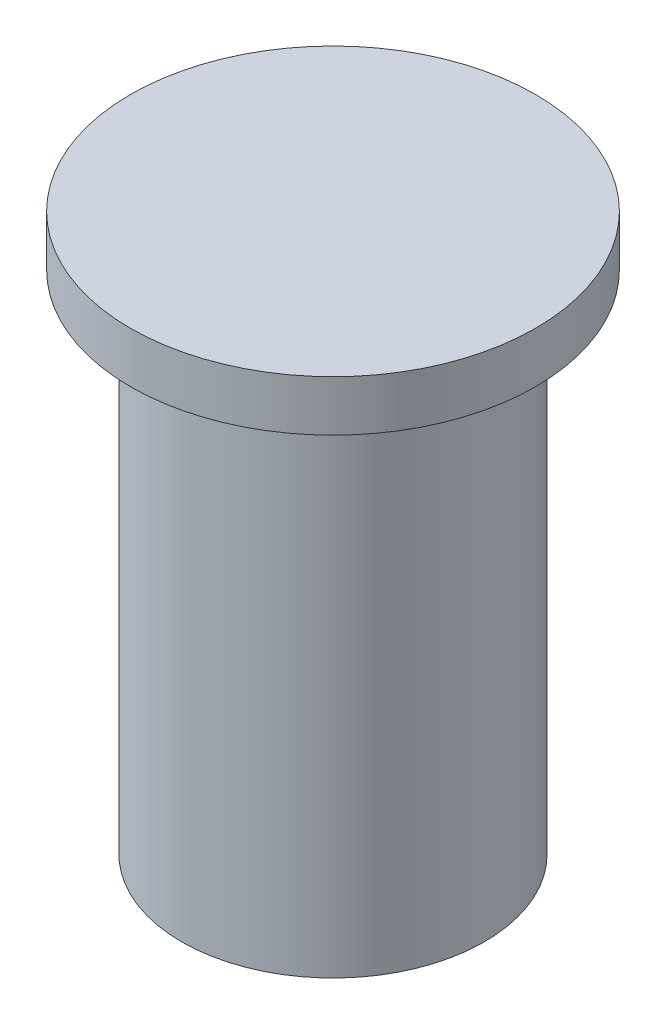
ISO-10303-21;
HEADER;
FILE_DESCRIPTION(('STEP AP214'),'2;1');
FILE_NAME('part.step','',(''),(''),'','','');
FILE_SCHEMA(('AUTOMOTIVE_DESIGN { 1 0 10303 214 1 1 1 1 }'));
ENDSEC;
DATA;
#1=APPLICATION_CONTEXT('core data for automotive mechanical design processes');
#2=APPLICATION_PROTOCOL_DEFINITION('international standard','automotive_design',2000,#1);
#3=PRODUCT_CONTEXT('',#1,'mechanical');
#4=PRODUCT('Part','Part','',(#3));
#5=PRODUCT_RELATED_PRODUCT_CATEGORY('part','',(#4));
#6=PRODUCT_DEFINITION_FORMATION('','',#4);
#7=PRODUCT_DEFINITION_CONTEXT('part definition',#1,'design');
#8=PRODUCT_DEFINITION('design','',#6,#7);
#9=PRODUCT_DEFINITION_SHAPE('','',#8);
#10=(LENGTH_UNIT() NAMED_UNIT(*) SI_UNIT(.MILLI.,.METRE.));
#11=(NAMED_UNIT(*) PLANE_ANGLE_UNIT() SI_UNIT($,.RADIAN.));
#12=(NAMED_UNIT(*) SI_UNIT($,.STERADIAN.) SOLID_ANGLE_UNIT());
#13=UNCERTAINTY_MEASURE_WITH_UNIT(LENGTH_MEASURE(1.E-05),#10,'distance_accuracy_value','');
#14=(GEOMETRIC_REPRESENTATION_CONTEXT(3) GLOBAL_UNCERTAINTY_ASSIGNED_CONTEXT((#13)) GLOBAL_UNIT_ASSIGNED_CONTEXT((#10,
#11,#12)) REPRESENTATION_CONTEXT('',''));
#15=CARTESIAN_POINT('',(0.,0.,0.));
#16=DIRECTION('',(0.,0.,1.));
#17=DIRECTION('',(1.,0.,0.));
#18=AXIS2_PLACEMENT_3D('',#15,#16,#17);
#19=CARTESIAN_POINT('',(0.,150.,0.));
#20=DIRECTION('',(0.,-1.,0.));
#21=DIRECTION('',(0.,0.,-1.));
#22=AXIS2_PLACEMENT_3D('',#19,#20,#21);
#23=CYLINDRICAL_SURFACE('',#22,44.85);
#24=CARTESIAN_POINT('',(0.,150.,0.));
#25=DIRECTION('',(0.,1.,0.));
#26=DIRECTION('',(0.,0.,1.));
#27=AXIS2_PLACEMENT_3D('',#24,#25,#26);
#28=CIRCLE('',#27,44.85);
#29=CARTESIAN_POINT('',(0.,150.,44.85));
#30=VERTEX_POINT('',#29);
#31=EDGE_CURVE('E10',#30,#30,#28,.T.);
#32=ORIENTED_EDGE('',*,*,#31,.F.);
#33=EDGE_LOOP('',(#32));
#34=FACE_BOUND('',#33,.T.);
#35=CARTESIAN_POINT('',(0.,0.,0.));
#36=DIRECTION('',(0.,1.,0.));
#37=DIRECTION('',(0.,0.,1.));
#38=AXIS2_PLACEMENT_3D('',#35,#36,#37);
#39=CIRCLE('',#38,44.85);
#40=CARTESIAN_POINT('',(0.,0.,44.85));
#41=VERTEX_POINT('',#40);
#42=EDGE_CURVE('E34',#41,#41,#39,.T.);
#43=ORIENTED_EDGE('',*,*,#42,.T.);
#44=EDGE_LOOP('',(#43));
#45=FACE_BOUND('',#44,.T.);
#46=ADVANCED_FACE('F31',(#34,#45),#23,.T.);
#47=CARTESIAN_POINT('',(0.,0.,0.));
#48=DIRECTION('',(0.,1.,0.));
#49=DIRECTION('',(0.,0.,1.));
#50=AXIS2_PLACEMENT_3D('',#47,#48,#49);
#51=PLANE('',#50);
#52=ORIENTED_EDGE('',*,*,#42,.F.);
#53=EDGE_LOOP('',(#52));
#54=FACE_BOUND('',#53,.T.);
#55=ADVANCED_FACE('F54',(#54),#51,.F.);
#56=CARTESIAN_POINT('',(0.,165.,0.));
#57=DIRECTION('',(0.,-1.,0.));
#58=DIRECTION('',(0.,0.,-1.));
#59=AXIS2_PLACEMENT_3D('',#56,#57,#58);
#60=CYLINDRICAL_SURFACE('',#59,60.);
#61=CARTESIAN_POINT('',(0.,165.,0.));
#62=DIRECTION('',(0.,1.,0.));
#63=DIRECTION('',(0.,0.,1.));
#64=AXIS2_PLACEMENT_3D('',#61,#62,#63);
#65=CIRCLE('',#64,60.);
#66=CARTESIAN_POINT('',(0.,165.,60.));
#67=VERTEX_POINT('',#66);
#68=EDGE_CURVE('E41',#67,#67,#65,.T.);
#69=ORIENTED_EDGE('',*,*,#68,.F.);
#70=EDGE_LOOP('',(#69));
#71=FACE_BOUND('',#70,.T.);
#72=CARTESIAN_POINT('',(0.,150.,0.));
#73=DIRECTION('',(0.,1.,0.));
#74=DIRECTION('',(0.,0.,1.));
#75=AXIS2_PLACEMENT_3D('',#72,#73,#74);
#76=CIRCLE('',#75,60.);
#77=CARTESIAN_POINT('',(0.,150.,60.));
#78=VERTEX_POINT('',#77);
#79=EDGE_CURVE('E43',#78,#78,#76,.T.);
#80=ORIENTED_EDGE('',*,*,#79,.T.);
#81=EDGE_LOOP('',(#80));
#82=FACE_BOUND('',#81,.T.);
#83=ADVANCED_FACE('F51',(#71,#82),#60,.T.);
#84=CARTESIAN_POINT('',(0.,165.,0.));
#85=DIRECTION('',(0.,1.,0.));
#86=DIRECTION('',(0.,0.,1.));
#87=AXIS2_PLACEMENT_3D('',#84,#85,#86);
#88=PLANE('',#87);
#89=ORIENTED_EDGE('',*,*,#68,.T.);
#90=EDGE_LOOP('',(#89));
#91=FACE_BOUND('',#90,.T.);
#92=ADVANCED_FACE('F49',(#91),#88,.T.);
#93=CARTESIAN_POINT('',(0.,150.,0.));
#94=DIRECTION('',(0.,1.,0.));
#95=DIRECTION('',(0.,0.,1.));
#96=AXIS2_PLACEMENT_3D('',#93,#94,#95);
#97=PLANE('',#96);
#98=ORIENTED_EDGE('',*,*,#31,.T.);
#99=EDGE_LOOP('',(#98));
#100=FACE_BOUND('',#99,.T.);
#101=ORIENTED_EDGE('',*,*,#79,.F.);
#102=EDGE_LOOP('',(#101));
#103=FACE_BOUND('',#102,.T.);
#104=ADVANCED_FACE('F58',(#100,#103),#97,.F.);
#105=CLOSED_SHELL('',(#46,#55,#83,#92,#104));
#106=MANIFOLD_SOLID_BREP('B2',#105);
#107=ADVANCED_BREP_SHAPE_REPRESENTATION('',(#18,#106),#14);
#108=SHAPE_DEFINITION_REPRESENTATION(#9,#107);
ENDSEC;
END-ISO-10303-21;
